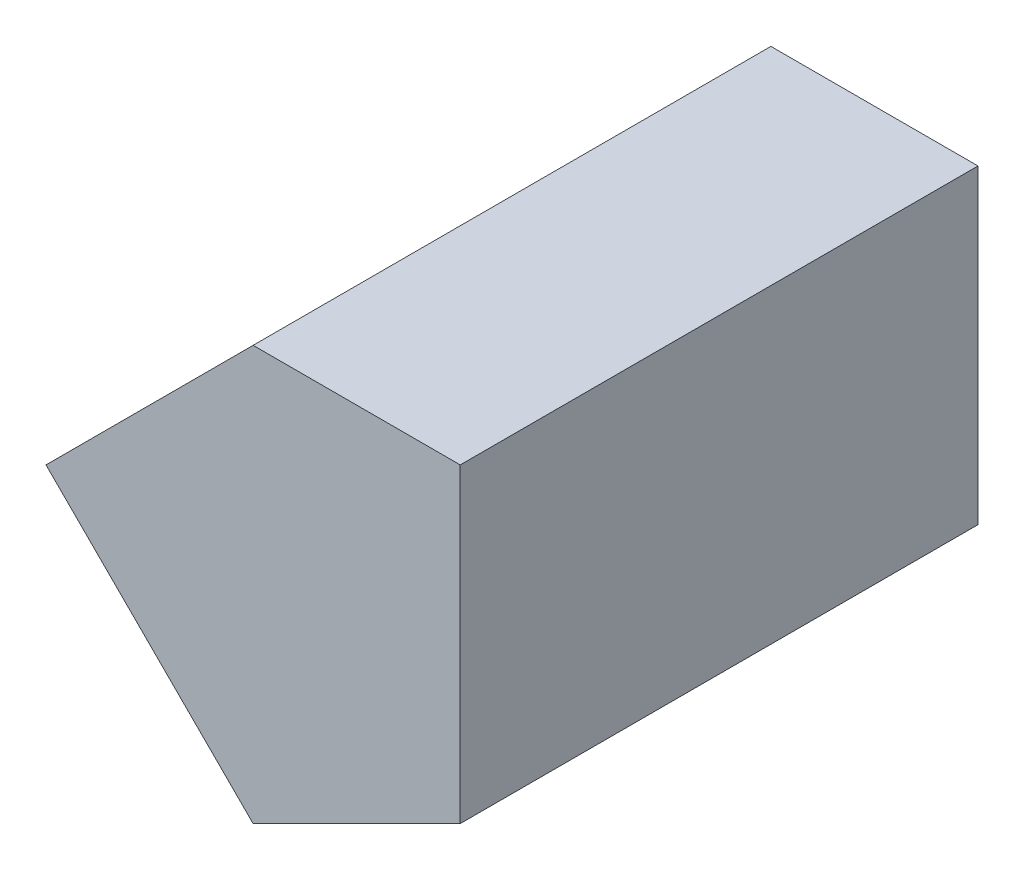
ISO-10303-21;
HEADER;
FILE_DESCRIPTION(('STEP AP214'),'2;1');
FILE_NAME('part.step','',(''),(''),'','','');
FILE_SCHEMA(('AUTOMOTIVE_DESIGN { 1 0 10303 214 1 1 1 1 }'));
ENDSEC;
DATA;
#1=APPLICATION_CONTEXT('core data for automotive mechanical design processes');
#2=APPLICATION_PROTOCOL_DEFINITION('international standard','automotive_design',2000,#1);
#3=PRODUCT_CONTEXT('',#1,'mechanical');
#4=PRODUCT('Part','Part','',(#3));
#5=PRODUCT_RELATED_PRODUCT_CATEGORY('part','',(#4));
#6=PRODUCT_DEFINITION_FORMATION('','',#4);
#7=PRODUCT_DEFINITION_CONTEXT('part definition',#1,'design');
#8=PRODUCT_DEFINITION('design','',#6,#7);
#9=PRODUCT_DEFINITION_SHAPE('','',#8);
#10=(LENGTH_UNIT() NAMED_UNIT(*) SI_UNIT(.MILLI.,.METRE.));
#11=(NAMED_UNIT(*) PLANE_ANGLE_UNIT() SI_UNIT($,.RADIAN.));
#12=(NAMED_UNIT(*) SI_UNIT($,.STERADIAN.) SOLID_ANGLE_UNIT());
#13=UNCERTAINTY_MEASURE_WITH_UNIT(LENGTH_MEASURE(1.E-05),#10,'distance_accuracy_value','');
#14=(GEOMETRIC_REPRESENTATION_CONTEXT(3) GLOBAL_UNCERTAINTY_ASSIGNED_CONTEXT((#13)) GLOBAL_UNIT_ASSIGNED_CONTEXT((#10,
#11,#12)) REPRESENTATION_CONTEXT('',''));
#15=CARTESIAN_POINT('',(0.,0.,0.));
#16=DIRECTION('',(0.,0.,1.));
#17=DIRECTION('',(1.,0.,0.));
#18=AXIS2_PLACEMENT_3D('',#15,#16,#17);
#19=CARTESIAN_POINT('',(-10.,-5.,25.));
#20=DIRECTION('',(0.707106781186548,0.707106781186547,0.));
#21=DIRECTION('',(-0.707106781186547,0.707106781186548,0.));
#22=AXIS2_PLACEMENT_3D('',#19,#20,#21);
#23=PLANE('',#22);
#24=DIRECTION('',(0.707106781186547,-0.707106781186548,0.));
#25=VECTOR('',#24,1.);
#26=CARTESIAN_POINT('',(-10.,-5.,0.));
#27=LINE('',#26,#25);
#28=CARTESIAN_POINT('',(-20.,5.,0.));
#29=VERTEX_POINT('',#28);
#30=CARTESIAN_POINT('',(-10.,-5.,0.));
#31=VERTEX_POINT('',#30);
#32=EDGE_CURVE('E107',#29,#31,#27,.T.);
#33=ORIENTED_EDGE('',*,*,#32,.T.);
#34=DIRECTION('',(0.,0.,-1.));
#35=VECTOR('',#34,1.);
#36=CARTESIAN_POINT('',(-10.,-5.,25.));
#37=LINE('',#36,#35);
#38=CARTESIAN_POINT('',(-10.,-5.,25.));
#39=VERTEX_POINT('',#38);
#40=EDGE_CURVE('E11',#39,#31,#37,.T.);
#41=ORIENTED_EDGE('',*,*,#40,.F.);
#42=DIRECTION('',(0.707106781186547,-0.707106781186548,0.));
#43=VECTOR('',#42,1.);
#44=CARTESIAN_POINT('',(-10.,-5.,25.));
#45=LINE('',#44,#43);
#46=CARTESIAN_POINT('',(-20.,5.,25.));
#47=VERTEX_POINT('',#46);
#48=EDGE_CURVE('E115',#47,#39,#45,.T.);
#49=ORIENTED_EDGE('',*,*,#48,.F.);
#50=DIRECTION('',(0.,0.,-1.));
#51=VECTOR('',#50,1.);
#52=CARTESIAN_POINT('',(-20.,5.,25.));
#53=LINE('',#52,#51);
#54=EDGE_CURVE('E103',#47,#29,#53,.T.);
#55=ORIENTED_EDGE('',*,*,#54,.T.);
#56=EDGE_LOOP('',(#33,#41,#49,#55));
#57=FACE_BOUND('',#56,.T.);
#58=ADVANCED_FACE('F33',(#57),#23,.F.);
#59=CARTESIAN_POINT('',(0.,0.,25.));
#60=DIRECTION('',(-0.447213595499957,0.894427190999916,0.));
#61=DIRECTION('',(-0.894427190999916,-0.447213595499957,0.));
#62=AXIS2_PLACEMENT_3D('',#59,#60,#61);
#63=PLANE('',#62);
#64=DIRECTION('',(0.894427190999916,0.447213595499957,0.));
#65=VECTOR('',#64,1.);
#66=CARTESIAN_POINT('',(0.,0.,0.));
#67=LINE('',#66,#65);
#68=CARTESIAN_POINT('',(0.,0.,0.));
#69=VERTEX_POINT('',#68);
#70=EDGE_CURVE('E110',#31,#69,#67,.T.);
#71=ORIENTED_EDGE('',*,*,#70,.T.);
#72=DIRECTION('',(0.,0.,-1.));
#73=VECTOR('',#72,1.);
#74=CARTESIAN_POINT('',(0.,0.,25.));
#75=LINE('',#74,#73);
#76=CARTESIAN_POINT('',(0.,0.,25.));
#77=VERTEX_POINT('',#76);
#78=EDGE_CURVE('E41',#77,#69,#75,.T.);
#79=ORIENTED_EDGE('',*,*,#78,.F.);
#80=DIRECTION('',(0.894427190999916,0.447213595499957,0.));
#81=VECTOR('',#80,1.);
#82=CARTESIAN_POINT('',(0.,0.,25.));
#83=LINE('',#82,#81);
#84=EDGE_CURVE('E83',#39,#77,#83,.T.);
#85=ORIENTED_EDGE('',*,*,#84,.F.);
#86=ORIENTED_EDGE('',*,*,#40,.T.);
#87=EDGE_LOOP('',(#71,#79,#85,#86));
#88=FACE_BOUND('',#87,.T.);
#89=ADVANCED_FACE('F134',(#88),#63,.F.);
#90=CARTESIAN_POINT('',(0.,15.,25.));
#91=DIRECTION('',(-1.,0.,0.));
#92=DIRECTION('',(0.,0.,1.));
#93=AXIS2_PLACEMENT_3D('',#90,#91,#92);
#94=PLANE('',#93);
#95=DIRECTION('',(0.,1.,0.));
#96=VECTOR('',#95,1.);
#97=CARTESIAN_POINT('',(0.,15.,0.));
#98=LINE('',#97,#96);
#99=CARTESIAN_POINT('',(0.,15.,0.));
#100=VERTEX_POINT('',#99);
#101=EDGE_CURVE('E98',#69,#100,#98,.T.);
#102=ORIENTED_EDGE('',*,*,#101,.T.);
#103=DIRECTION('',(0.,0.,-1.));
#104=VECTOR('',#103,1.);
#105=CARTESIAN_POINT('',(0.,15.,25.));
#106=LINE('',#105,#104);
#107=CARTESIAN_POINT('',(0.,15.,25.));
#108=VERTEX_POINT('',#107);
#109=EDGE_CURVE('E95',#108,#100,#106,.T.);
#110=ORIENTED_EDGE('',*,*,#109,.F.);
#111=DIRECTION('',(0.,1.,0.));
#112=VECTOR('',#111,1.);
#113=CARTESIAN_POINT('',(0.,15.,25.));
#114=LINE('',#113,#112);
#115=EDGE_CURVE('E87',#77,#108,#114,.T.);
#116=ORIENTED_EDGE('',*,*,#115,.F.);
#117=ORIENTED_EDGE('',*,*,#78,.T.);
#118=EDGE_LOOP('',(#102,#110,#116,#117));
#119=FACE_BOUND('',#118,.T.);
#120=ADVANCED_FACE('F96',(#119),#94,.F.);
#121=CARTESIAN_POINT('',(-10.,15.,25.));
#122=DIRECTION('',(0.,-1.,0.));
#123=DIRECTION('',(1.,0.,0.));
#124=AXIS2_PLACEMENT_3D('',#121,#122,#123);
#125=PLANE('',#124);
#126=DIRECTION('',(-1.,0.,0.));
#127=VECTOR('',#126,1.);
#128=CARTESIAN_POINT('',(-10.,15.,0.));
#129=LINE('',#128,#127);
#130=CARTESIAN_POINT('',(-10.,15.,0.));
#131=VERTEX_POINT('',#130);
#132=EDGE_CURVE('E69',#100,#131,#129,.T.);
#133=ORIENTED_EDGE('',*,*,#132,.T.);
#134=DIRECTION('',(0.,0.,-1.));
#135=VECTOR('',#134,1.);
#136=CARTESIAN_POINT('',(-10.,15.,25.));
#137=LINE('',#136,#135);
#138=CARTESIAN_POINT('',(-10.,15.,25.));
#139=VERTEX_POINT('',#138);
#140=EDGE_CURVE('E99',#139,#131,#137,.T.);
#141=ORIENTED_EDGE('',*,*,#140,.F.);
#142=DIRECTION('',(-1.,0.,0.));
#143=VECTOR('',#142,1.);
#144=CARTESIAN_POINT('',(-10.,15.,25.));
#145=LINE('',#144,#143);
#146=EDGE_CURVE('E91',#108,#139,#145,.T.);
#147=ORIENTED_EDGE('',*,*,#146,.F.);
#148=ORIENTED_EDGE('',*,*,#109,.T.);
#149=EDGE_LOOP('',(#133,#141,#147,#148));
#150=FACE_BOUND('',#149,.T.);
#151=ADVANCED_FACE('F101',(#150),#125,.F.);
#152=CARTESIAN_POINT('',(-20.,5.,25.));
#153=DIRECTION('',(0.707106781186547,-0.707106781186548,0.));
#154=DIRECTION('',(0.707106781186548,0.707106781186547,0.));
#155=AXIS2_PLACEMENT_3D('',#152,#153,#154);
#156=PLANE('',#155);
#157=DIRECTION('',(-0.707106781186548,-0.707106781186547,0.));
#158=VECTOR('',#157,1.);
#159=CARTESIAN_POINT('',(-20.,5.,0.));
#160=LINE('',#159,#158);
#161=EDGE_CURVE('E75',#131,#29,#160,.T.);
#162=ORIENTED_EDGE('',*,*,#161,.T.);
#163=ORIENTED_EDGE('',*,*,#54,.F.);
#164=DIRECTION('',(-0.707106781186548,-0.707106781186547,0.));
#165=VECTOR('',#164,1.);
#166=CARTESIAN_POINT('',(-20.,5.,25.));
#167=LINE('',#166,#165);
#168=EDGE_CURVE('E49',#139,#47,#167,.T.);
#169=ORIENTED_EDGE('',*,*,#168,.F.);
#170=ORIENTED_EDGE('',*,*,#140,.T.);
#171=EDGE_LOOP('',(#162,#163,#169,#170));
#172=FACE_BOUND('',#171,.T.);
#173=ADVANCED_FACE('F123',(#172),#156,.F.);
#174=CARTESIAN_POINT('',(0.,0.,25.));
#175=DIRECTION('',(0.,0.,-1.));
#176=DIRECTION('',(-1.,0.,0.));
#177=AXIS2_PLACEMENT_3D('',#174,#175,#176);
#178=PLANE('',#177);
#179=ORIENTED_EDGE('',*,*,#48,.T.);
#180=ORIENTED_EDGE('',*,*,#84,.T.);
#181=ORIENTED_EDGE('',*,*,#115,.T.);
#182=ORIENTED_EDGE('',*,*,#146,.T.);
#183=ORIENTED_EDGE('',*,*,#168,.T.);
#184=EDGE_LOOP('',(#179,#180,#181,#182,#183));
#185=FACE_BOUND('',#184,.T.);
#186=ADVANCED_FACE('F89',(#185),#178,.F.);
#187=CARTESIAN_POINT('',(0.,0.,0.));
#188=DIRECTION('',(0.,0.,-1.));
#189=DIRECTION('',(-1.,0.,0.));
#190=AXIS2_PLACEMENT_3D('',#187,#188,#189);
#191=PLANE('',#190);
#192=ORIENTED_EDGE('',*,*,#32,.F.);
#193=ORIENTED_EDGE('',*,*,#161,.F.);
#194=ORIENTED_EDGE('',*,*,#132,.F.);
#195=ORIENTED_EDGE('',*,*,#101,.F.);
#196=ORIENTED_EDGE('',*,*,#70,.F.);
#197=EDGE_LOOP('',(#192,#193,#194,#195,#196));
#198=FACE_BOUND('',#197,.T.);
#199=ADVANCED_FACE('F119',(#198),#191,.T.);
#200=CLOSED_SHELL('',(#58,#89,#120,#151,#173,#186,#199));
#201=MANIFOLD_SOLID_BREP('B2',#200);
#202=ADVANCED_BREP_SHAPE_REPRESENTATION('',(#18,#201),#14);
#203=SHAPE_DEFINITION_REPRESENTATION(#9,#202);
ENDSEC;
END-ISO-10303-21;
